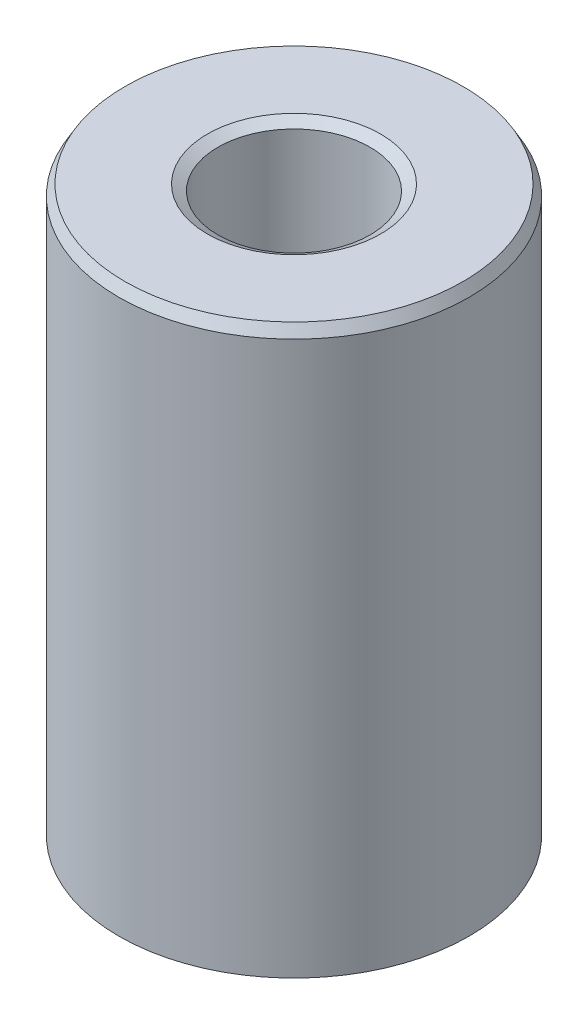
ISO-10303-21;
HEADER;
FILE_DESCRIPTION(('STEP AP214'),'2;1');
FILE_NAME('part.step','',(''),(''),'','','');
FILE_SCHEMA(('AUTOMOTIVE_DESIGN { 1 0 10303 214 1 1 1 1 }'));
ENDSEC;
DATA;
#1=APPLICATION_CONTEXT('core data for automotive mechanical design processes');
#2=APPLICATION_PROTOCOL_DEFINITION('international standard','automotive_design',2000,#1);
#3=PRODUCT_CONTEXT('',#1,'mechanical');
#4=PRODUCT('Part','Part','',(#3));
#5=PRODUCT_RELATED_PRODUCT_CATEGORY('part','',(#4));
#6=PRODUCT_DEFINITION_FORMATION('','',#4);
#7=PRODUCT_DEFINITION_CONTEXT('part definition',#1,'design');
#8=PRODUCT_DEFINITION('design','',#6,#7);
#9=PRODUCT_DEFINITION_SHAPE('','',#8);
#10=(LENGTH_UNIT() NAMED_UNIT(*) SI_UNIT(.MILLI.,.METRE.));
#11=(NAMED_UNIT(*) PLANE_ANGLE_UNIT() SI_UNIT($,.RADIAN.));
#12=(NAMED_UNIT(*) SI_UNIT($,.STERADIAN.) SOLID_ANGLE_UNIT());
#13=UNCERTAINTY_MEASURE_WITH_UNIT(LENGTH_MEASURE(1.E-05),#10,'distance_accuracy_value','');
#14=(GEOMETRIC_REPRESENTATION_CONTEXT(3) GLOBAL_UNCERTAINTY_ASSIGNED_CONTEXT((#13)) GLOBAL_UNIT_ASSIGNED_CONTEXT((#10,
#11,#12)) REPRESENTATION_CONTEXT('',''));
#15=CARTESIAN_POINT('',(0.,0.,0.));
#16=DIRECTION('',(0.,0.,1.));
#17=DIRECTION('',(1.,0.,0.));
#18=AXIS2_PLACEMENT_3D('',#15,#16,#17);
#19=CARTESIAN_POINT('',(0.,178.997872923293,0.));
#20=DIRECTION('',(0.,-1.,0.));
#21=DIRECTION('',(0.,0.,-1.));
#22=AXIS2_PLACEMENT_3D('',#19,#20,#21);
#23=CYLINDRICAL_SURFACE('',#22,55.);
#24=CARTESIAN_POINT('',(0.,1.91588635067932,0.));
#25=DIRECTION('',(0.,1.,0.));
#26=DIRECTION('',(0.,0.,1.));
#27=AXIS2_PLACEMENT_3D('',#24,#25,#26);
#28=CIRCLE('',#27,55.);
#29=CARTESIAN_POINT('',(0.,1.91588635067932,55.));
#30=VERTEX_POINT('',#29);
#31=EDGE_CURVE('E10',#30,#30,#28,.T.);
#32=ORIENTED_EDGE('',*,*,#31,.T.);
#33=EDGE_LOOP('',(#32));
#34=FACE_BOUND('',#33,.T.);
#35=CARTESIAN_POINT('',(0.,175.679460422388,0.));
#36=DIRECTION('',(0.,1.,0.));
#37=DIRECTION('',(0.,0.,1.));
#38=AXIS2_PLACEMENT_3D('',#35,#36,#37);
#39=CIRCLE('',#38,55.);
#40=CARTESIAN_POINT('',(0.,175.679460422388,55.));
#41=VERTEX_POINT('',#40);
#42=EDGE_CURVE('E50',#41,#41,#39,.F.);
#43=ORIENTED_EDGE('',*,*,#42,.T.);
#44=EDGE_LOOP('',(#43));
#45=FACE_BOUND('',#44,.T.);
#46=ADVANCED_FACE('F39',(#34,#45),#23,.T.);
#47=CARTESIAN_POINT('',(0.,178.997872923293,0.));
#48=DIRECTION('',(0.,1.,0.));
#49=DIRECTION('',(0.,0.,1.));
#50=AXIS2_PLACEMENT_3D('',#47,#48,#49);
#51=PLANE('',#50);
#52=CARTESIAN_POINT('',(0.,178.997872923293,0.));
#53=DIRECTION('',(0.,1.,0.));
#54=DIRECTION('',(0.,0.,1.));
#55=AXIS2_PLACEMENT_3D('',#52,#53,#54);
#56=CIRCLE('',#55,27.2080404578684);
#57=CARTESIAN_POINT('',(0.,178.997872923293,27.2080404578684));
#58=VERTEX_POINT('',#57);
#59=EDGE_CURVE('E58',#58,#58,#56,.F.);
#60=ORIENTED_EDGE('',*,*,#59,.T.);
#61=EDGE_LOOP('',(#60));
#62=FACE_BOUND('',#61,.T.);
#63=CARTESIAN_POINT('',(0.,178.997872923293,0.));
#64=DIRECTION('',(0.,1.,0.));
#65=DIRECTION('',(0.,0.,1.));
#66=AXIS2_PLACEMENT_3D('',#63,#64,#65);
#67=CIRCLE('',#66,53.0841136493207);
#68=CARTESIAN_POINT('',(0.,178.997872923293,53.0841136493207));
#69=VERTEX_POINT('',#68);
#70=EDGE_CURVE('E61',#69,#69,#67,.T.);
#71=ORIENTED_EDGE('',*,*,#70,.T.);
#72=EDGE_LOOP('',(#71));
#73=FACE_BOUND('',#72,.T.);
#74=ADVANCED_FACE('F88',(#62,#73),#51,.T.);
#75=CARTESIAN_POINT('',(0.,0.,0.));
#76=DIRECTION('',(0.,1.,0.));
#77=DIRECTION('',(0.,0.,1.));
#78=AXIS2_PLACEMENT_3D('',#75,#76,#77);
#79=PLANE('',#78);
#80=CARTESIAN_POINT('',(0.,0.,0.));
#81=DIRECTION('',(0.,1.,0.));
#82=DIRECTION('',(0.,0.,1.));
#83=AXIS2_PLACEMENT_3D('',#80,#81,#82);
#84=CIRCLE('',#83,25.8055143076433);
#85=CARTESIAN_POINT('',(0.,0.,25.8055143076433));
#86=VERTEX_POINT('',#85);
#87=EDGE_CURVE('E51',#86,#86,#84,.T.);
#88=ORIENTED_EDGE('',*,*,#87,.T.);
#89=EDGE_LOOP('',(#88));
#90=FACE_BOUND('',#89,.T.);
#91=CARTESIAN_POINT('',(0.,0.,0.));
#92=DIRECTION('',(0.,1.,0.));
#93=DIRECTION('',(0.,0.,1.));
#94=AXIS2_PLACEMENT_3D('',#91,#92,#93);
#95=CIRCLE('',#94,51.6815874990957);
#96=CARTESIAN_POINT('',(0.,0.,51.6815874990957));
#97=VERTEX_POINT('',#96);
#98=EDGE_CURVE('E54',#97,#97,#95,.F.);
#99=ORIENTED_EDGE('',*,*,#98,.T.);
#100=EDGE_LOOP('',(#99));
#101=FACE_BOUND('',#100,.T.);
#102=ADVANCED_FACE('F83',(#90,#101),#79,.F.);
#103=CARTESIAN_POINT('',(0.,178.997872923293,0.));
#104=DIRECTION('',(0.,-1.,0.));
#105=DIRECTION('',(0.,0.,-1.));
#106=AXIS2_PLACEMENT_3D('',#103,#104,#105);
#107=CYLINDRICAL_SURFACE('',#106,23.889627956964);
#108=CARTESIAN_POINT('',(0.,177.081986572613,0.));
#109=DIRECTION('',(0.,1.,0.));
#110=DIRECTION('',(0.,0.,1.));
#111=AXIS2_PLACEMENT_3D('',#108,#109,#110);
#112=CIRCLE('',#111,23.889627956964);
#113=CARTESIAN_POINT('',(0.,177.081986572613,23.889627956964));
#114=VERTEX_POINT('',#113);
#115=EDGE_CURVE('E67',#114,#114,#112,.T.);
#116=ORIENTED_EDGE('',*,*,#115,.T.);
#117=EDGE_LOOP('',(#116));
#118=FACE_BOUND('',#117,.T.);
#119=CARTESIAN_POINT('',(0.,3.31841250090428,0.));
#120=DIRECTION('',(0.,1.,0.));
#121=DIRECTION('',(0.,0.,1.));
#122=AXIS2_PLACEMENT_3D('',#119,#120,#121);
#123=CIRCLE('',#122,23.889627956964);
#124=CARTESIAN_POINT('',(0.,3.31841250090428,23.889627956964));
#125=VERTEX_POINT('',#124);
#126=EDGE_CURVE('E69',#125,#125,#123,.F.);
#127=ORIENTED_EDGE('',*,*,#126,.T.);
#128=EDGE_LOOP('',(#127));
#129=FACE_BOUND('',#128,.T.);
#130=ADVANCED_FACE('F71',(#118,#129),#107,.F.);
#131=CARTESIAN_POINT('',(0.,177.081986572613,0.));
#132=DIRECTION('',(0.,1.,0.));
#133=DIRECTION('',(0.,0.,1.));
#134=AXIS2_PLACEMENT_3D('',#131,#132,#133);
#135=CONICAL_SURFACE('',#134,23.889627956964,1.0471975511966);
#136=ORIENTED_EDGE('',*,*,#59,.F.);
#137=EDGE_LOOP('',(#136));
#138=FACE_BOUND('',#137,.T.);
#139=ORIENTED_EDGE('',*,*,#115,.F.);
#140=EDGE_LOOP('',(#139));
#141=FACE_BOUND('',#140,.T.);
#142=ADVANCED_FACE('F77',(#138,#141),#135,.F.);
#143=CARTESIAN_POINT('',(0.,0.,0.));
#144=DIRECTION('',(0.,-1.,0.));
#145=DIRECTION('',(0.,0.,-1.));
#146=AXIS2_PLACEMENT_3D('',#143,#144,#145);
#147=CONICAL_SURFACE('',#146,25.8055143076433,0.523598775598297);
#148=ORIENTED_EDGE('',*,*,#126,.F.);
#149=EDGE_LOOP('',(#148));
#150=FACE_BOUND('',#149,.T.);
#151=ORIENTED_EDGE('',*,*,#87,.F.);
#152=EDGE_LOOP('',(#151));
#153=FACE_BOUND('',#152,.T.);
#154=ADVANCED_FACE('F73',(#150,#153),#147,.F.);
#155=CARTESIAN_POINT('',(0.,1.91588635067932,0.));
#156=DIRECTION('',(0.,1.,0.));
#157=DIRECTION('',(0.,0.,1.));
#158=AXIS2_PLACEMENT_3D('',#155,#156,#157);
#159=CONICAL_SURFACE('',#158,55.,1.0471975511966);
#160=ORIENTED_EDGE('',*,*,#98,.F.);
#161=EDGE_LOOP('',(#160));
#162=FACE_BOUND('',#161,.T.);
#163=ORIENTED_EDGE('',*,*,#31,.F.);
#164=EDGE_LOOP('',(#163));
#165=FACE_BOUND('',#164,.T.);
#166=ADVANCED_FACE('F76',(#162,#165),#159,.T.);
#167=CARTESIAN_POINT('',(0.,178.997872923293,0.));
#168=DIRECTION('',(0.,-1.,0.));
#169=DIRECTION('',(0.,0.,-1.));
#170=AXIS2_PLACEMENT_3D('',#167,#168,#169);
#171=CONICAL_SURFACE('',#170,53.0841136493207,0.523598775598293);
#172=ORIENTED_EDGE('',*,*,#42,.F.);
#173=EDGE_LOOP('',(#172));
#174=FACE_BOUND('',#173,.T.);
#175=ORIENTED_EDGE('',*,*,#70,.F.);
#176=EDGE_LOOP('',(#175));
#177=FACE_BOUND('',#176,.T.);
#178=ADVANCED_FACE('F45',(#174,#177),#171,.T.);
#179=CLOSED_SHELL('',(#46,#74,#102,#130,#142,#154,#166,#178));
#180=MANIFOLD_SOLID_BREP('B2',#179);
#181=ADVANCED_BREP_SHAPE_REPRESENTATION('',(#18,#180),#14);
#182=SHAPE_DEFINITION_REPRESENTATION(#9,#181);
ENDSEC;
END-ISO-10303-21;
